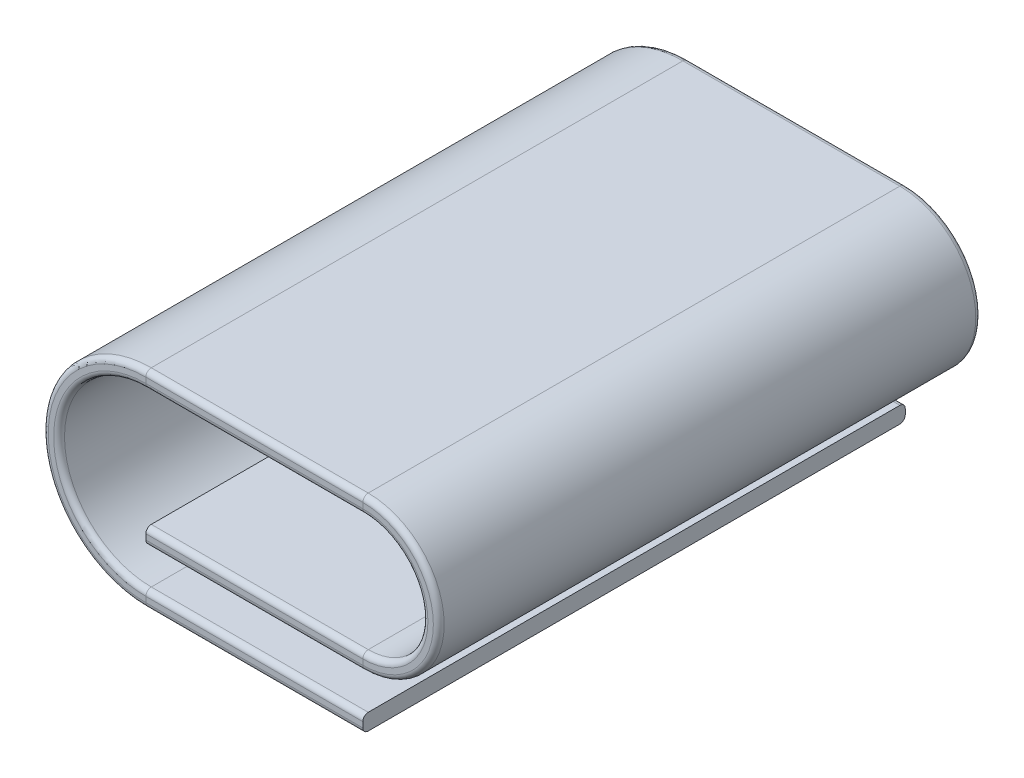
ISO-10303-21;
HEADER;
FILE_DESCRIPTION(('STEP AP214'),'2;1');
FILE_NAME('part.step','',(''),(''),'','','');
FILE_SCHEMA(('AUTOMOTIVE_DESIGN { 1 0 10303 214 1 1 1 1 }'));
ENDSEC;
DATA;
#1=APPLICATION_CONTEXT('core data for automotive mechanical design processes');
#2=APPLICATION_PROTOCOL_DEFINITION('international standard','automotive_design',2000,#1);
#3=PRODUCT_CONTEXT('',#1,'mechanical');
#4=PRODUCT('Part','Part','',(#3));
#5=PRODUCT_RELATED_PRODUCT_CATEGORY('part','',(#4));
#6=PRODUCT_DEFINITION_FORMATION('','',#4);
#7=PRODUCT_DEFINITION_CONTEXT('part definition',#1,'design');
#8=PRODUCT_DEFINITION('design','',#6,#7);
#9=PRODUCT_DEFINITION_SHAPE('','',#8);
#10=(LENGTH_UNIT() NAMED_UNIT(*) SI_UNIT(.MILLI.,.METRE.));
#11=(NAMED_UNIT(*) PLANE_ANGLE_UNIT() SI_UNIT($,.RADIAN.));
#12=(NAMED_UNIT(*) SI_UNIT($,.STERADIAN.) SOLID_ANGLE_UNIT());
#13=UNCERTAINTY_MEASURE_WITH_UNIT(LENGTH_MEASURE(1.E-05),#10,'distance_accuracy_value','');
#14=(GEOMETRIC_REPRESENTATION_CONTEXT(3) GLOBAL_UNCERTAINTY_ASSIGNED_CONTEXT((#13)) GLOBAL_UNIT_ASSIGNED_CONTEXT((#10,
#11,#12)) REPRESENTATION_CONTEXT('',''));
#15=CARTESIAN_POINT('',(0.,0.,0.));
#16=DIRECTION('',(0.,0.,1.));
#17=DIRECTION('',(1.,0.,0.));
#18=AXIS2_PLACEMENT_3D('',#15,#16,#17);
#19=CARTESIAN_POINT('',(1.,1.6,2.5));
#20=DIRECTION('',(0.,0.,1.));
#21=DIRECTION('',(1.,0.,0.));
#22=AXIS2_PLACEMENT_3D('',#19,#20,#21);
#23=PLANE('',#22);
#24=DIRECTION('',(0.,1.,0.));
#25=VECTOR('',#24,1.);
#26=CARTESIAN_POINT('',(1.,0.35,2.5));
#27=LINE('',#26,#25);
#28=CARTESIAN_POINT('',(1.,0.4,2.5));
#29=VERTEX_POINT('',#28);
#30=CARTESIAN_POINT('',(1.,0.45,2.5));
#31=VERTEX_POINT('',#30);
#32=EDGE_CURVE('E230',#29,#31,#27,.T.);
#33=ORIENTED_EDGE('',*,*,#32,.F.);
#34=CARTESIAN_POINT('',(1.,1.05,2.5));
#35=DIRECTION('',(0.,0.,1.));
#36=DIRECTION('',(1.,0.,0.));
#37=AXIS2_PLACEMENT_3D('',#34,#35,#36);
#38=CIRCLE('',#37,0.65);
#39=CARTESIAN_POINT('',(1.,1.7,2.5));
#40=VERTEX_POINT('',#39);
#41=EDGE_CURVE('E216',#29,#40,#38,.T.);
#42=ORIENTED_EDGE('',*,*,#41,.T.);
#43=DIRECTION('',(0.,1.,0.));
#44=VECTOR('',#43,1.);
#45=CARTESIAN_POINT('',(1.,1.6,2.5));
#46=LINE('',#45,#44);
#47=CARTESIAN_POINT('',(1.,1.65,2.5));
#48=VERTEX_POINT('',#47);
#49=EDGE_CURVE('E238',#48,#40,#46,.T.);
#50=ORIENTED_EDGE('',*,*,#49,.F.);
#51=CARTESIAN_POINT('',(1.,1.05,2.5));
#52=DIRECTION('',(0.,0.,1.));
#53=DIRECTION('',(1.,0.,0.));
#54=AXIS2_PLACEMENT_3D('',#51,#52,#53);
#55=CIRCLE('',#54,0.6);
#56=EDGE_CURVE('E224',#48,#31,#55,.F.);
#57=ORIENTED_EDGE('',*,*,#56,.T.);
#58=EDGE_LOOP('',(#33,#42,#50,#57));
#59=FACE_BOUND('',#58,.T.);
#60=ADVANCED_FACE('F39',(#59),#23,.T.);
#61=CARTESIAN_POINT('',(1.,0.35,2.5));
#62=DIRECTION('',(0.,0.,1.));
#63=DIRECTION('',(1.,0.,0.));
#64=AXIS2_PLACEMENT_3D('',#61,#62,#63);
#65=PLANE('',#64);
#66=ORIENTED_EDGE('',*,*,#49,.T.);
#67=DIRECTION('',(-1.,0.,0.));
#68=VECTOR('',#67,1.);
#69=CARTESIAN_POINT('',(-1.,1.7,2.5));
#70=LINE('',#69,#68);
#71=CARTESIAN_POINT('',(-1.,1.7,2.5));
#72=VERTEX_POINT('',#71);
#73=EDGE_CURVE('E322',#40,#72,#70,.T.);
#74=ORIENTED_EDGE('',*,*,#73,.T.);
#75=DIRECTION('',(0.,-1.,0.));
#76=VECTOR('',#75,1.);
#77=CARTESIAN_POINT('',(-1.,1.75,2.5));
#78=LINE('',#77,#76);
#79=CARTESIAN_POINT('',(-1.,1.65,2.5));
#80=VERTEX_POINT('',#79);
#81=EDGE_CURVE('E440',#72,#80,#78,.T.);
#82=ORIENTED_EDGE('',*,*,#81,.T.);
#83=DIRECTION('',(-1.,0.,0.));
#84=VECTOR('',#83,1.);
#85=CARTESIAN_POINT('',(1.,1.65,2.5));
#86=LINE('',#85,#84);
#87=EDGE_CURVE('E320',#80,#48,#86,.F.);
#88=ORIENTED_EDGE('',*,*,#87,.T.);
#89=EDGE_LOOP('',(#66,#74,#82,#88));
#90=FACE_BOUND('',#89,.T.);
#91=ADVANCED_FACE('F502',(#90),#65,.T.);
#92=CARTESIAN_POINT('',(1.,0.5,-2.5));
#93=DIRECTION('',(0.,0.,-1.));
#94=DIRECTION('',(-1.,0.,0.));
#95=AXIS2_PLACEMENT_3D('',#92,#93,#94);
#96=PLANE('',#95);
#97=DIRECTION('',(0.,-1.,0.));
#98=VECTOR('',#97,1.);
#99=CARTESIAN_POINT('',(1.,1.75,-2.5));
#100=LINE('',#99,#98);
#101=CARTESIAN_POINT('',(1.,1.7,-2.5));
#102=VERTEX_POINT('',#101);
#103=CARTESIAN_POINT('',(1.,1.65,-2.5));
#104=VERTEX_POINT('',#103);
#105=EDGE_CURVE('E243',#102,#104,#100,.T.);
#106=ORIENTED_EDGE('',*,*,#105,.F.);
#107=CARTESIAN_POINT('',(1.,1.05,-2.5));
#108=DIRECTION('',(0.,0.,-1.));
#109=DIRECTION('',(-1.,0.,0.));
#110=AXIS2_PLACEMENT_3D('',#107,#108,#109);
#111=CIRCLE('',#110,0.65);
#112=CARTESIAN_POINT('',(1.,0.4,-2.5));
#113=VERTEX_POINT('',#112);
#114=EDGE_CURVE('E311',#102,#113,#111,.T.);
#115=ORIENTED_EDGE('',*,*,#114,.T.);
#116=DIRECTION('',(0.,-1.,0.));
#117=VECTOR('',#116,1.);
#118=CARTESIAN_POINT('',(1.,0.5,-2.5));
#119=LINE('',#118,#117);
#120=CARTESIAN_POINT('',(1.,0.45,-2.5));
#121=VERTEX_POINT('',#120);
#122=EDGE_CURVE('E239',#121,#113,#119,.T.);
#123=ORIENTED_EDGE('',*,*,#122,.F.);
#124=CARTESIAN_POINT('',(1.,1.05,-2.5));
#125=DIRECTION('',(0.,0.,-1.));
#126=DIRECTION('',(-1.,0.,0.));
#127=AXIS2_PLACEMENT_3D('',#124,#125,#126);
#128=CIRCLE('',#127,0.6);
#129=EDGE_CURVE('E309',#121,#104,#128,.F.);
#130=ORIENTED_EDGE('',*,*,#129,.T.);
#131=EDGE_LOOP('',(#106,#115,#123,#130));
#132=FACE_BOUND('',#131,.T.);
#133=ADVANCED_FACE('F565',(#132),#96,.T.);
#134=CARTESIAN_POINT('',(1.,1.75,-2.5));
#135=DIRECTION('',(0.,0.,-1.));
#136=DIRECTION('',(-1.,0.,0.));
#137=AXIS2_PLACEMENT_3D('',#134,#135,#136);
#138=PLANE('',#137);
#139=ORIENTED_EDGE('',*,*,#122,.T.);
#140=DIRECTION('',(1.,0.,0.));
#141=VECTOR('',#140,1.);
#142=CARTESIAN_POINT('',(-1.,0.4,-2.5));
#143=LINE('',#142,#141);
#144=CARTESIAN_POINT('',(-1.,0.4,-2.5));
#145=VERTEX_POINT('',#144);
#146=EDGE_CURVE('E307',#113,#145,#143,.F.);
#147=ORIENTED_EDGE('',*,*,#146,.T.);
#148=DIRECTION('',(0.,1.,0.));
#149=VECTOR('',#148,1.);
#150=CARTESIAN_POINT('',(-1.,0.35,-2.5));
#151=LINE('',#150,#149);
#152=CARTESIAN_POINT('',(-1.,0.45,-2.5));
#153=VERTEX_POINT('',#152);
#154=EDGE_CURVE('E395',#145,#153,#151,.T.);
#155=ORIENTED_EDGE('',*,*,#154,.T.);
#156=DIRECTION('',(1.,0.,0.));
#157=VECTOR('',#156,1.);
#158=CARTESIAN_POINT('',(1.,0.45,-2.5));
#159=LINE('',#158,#157);
#160=EDGE_CURVE('E304',#153,#121,#159,.T.);
#161=ORIENTED_EDGE('',*,*,#160,.T.);
#162=EDGE_LOOP('',(#139,#147,#155,#161));
#163=FACE_BOUND('',#162,.T.);
#164=ADVANCED_FACE('F476',(#163),#138,.T.);
#165=CARTESIAN_POINT('',(-1.,0.,2.5));
#166=DIRECTION('',(0.,0.,1.));
#167=DIRECTION('',(1.,0.,0.));
#168=AXIS2_PLACEMENT_3D('',#165,#166,#167);
#169=PLANE('',#168);
#170=ORIENTED_EDGE('',*,*,#81,.F.);
#171=CARTESIAN_POINT('',(-1.,0.8,2.5));
#172=DIRECTION('',(0.,0.,1.));
#173=DIRECTION('',(1.,0.,0.));
#174=AXIS2_PLACEMENT_3D('',#171,#172,#173);
#175=CIRCLE('',#174,0.9);
#176=CARTESIAN_POINT('',(-1.,-0.0999999999999998,2.5));
#177=VERTEX_POINT('',#176);
#178=EDGE_CURVE('E281',#72,#177,#175,.T.);
#179=ORIENTED_EDGE('',*,*,#178,.T.);
#180=DIRECTION('',(0.,-1.,0.));
#181=VECTOR('',#180,1.);
#182=CARTESIAN_POINT('',(-1.,0.,2.5));
#183=LINE('',#182,#181);
#184=CARTESIAN_POINT('',(-1.,-0.0499999999999999,2.5));
#185=VERTEX_POINT('',#184);
#186=EDGE_CURVE('E443',#185,#177,#183,.T.);
#187=ORIENTED_EDGE('',*,*,#186,.F.);
#188=CARTESIAN_POINT('',(-1.,0.8,2.5));
#189=DIRECTION('',(0.,0.,1.));
#190=DIRECTION('',(1.,0.,0.));
#191=AXIS2_PLACEMENT_3D('',#188,#189,#190);
#192=CIRCLE('',#191,0.85);
#193=EDGE_CURVE('E279',#185,#80,#192,.F.);
#194=ORIENTED_EDGE('',*,*,#193,.T.);
#195=EDGE_LOOP('',(#170,#179,#187,#194));
#196=FACE_BOUND('',#195,.T.);
#197=ADVANCED_FACE('F506',(#196),#169,.T.);
#198=CARTESIAN_POINT('',(-1.,1.75,2.5));
#199=DIRECTION('',(0.,0.,1.));
#200=DIRECTION('',(1.,0.,0.));
#201=AXIS2_PLACEMENT_3D('',#198,#199,#200);
#202=PLANE('',#201);
#203=ORIENTED_EDGE('',*,*,#186,.T.);
#204=DIRECTION('',(1.,0.,0.));
#205=VECTOR('',#204,1.);
#206=CARTESIAN_POINT('',(1.,-0.1,2.5));
#207=LINE('',#206,#205);
#208=CARTESIAN_POINT('',(1.,-0.1,2.5));
#209=VERTEX_POINT('',#208);
#210=EDGE_CURVE('E265',#177,#209,#207,.T.);
#211=ORIENTED_EDGE('',*,*,#210,.T.);
#212=DIRECTION('',(0.,-1.,0.));
#213=VECTOR('',#212,1.);
#214=CARTESIAN_POINT('',(1.,0.,2.5));
#215=LINE('',#214,#213);
#216=CARTESIAN_POINT('',(1.,-0.05,2.5));
#217=VERTEX_POINT('',#216);
#218=EDGE_CURVE('E398',#217,#209,#215,.T.);
#219=ORIENTED_EDGE('',*,*,#218,.F.);
#220=DIRECTION('',(1.,0.,0.));
#221=VECTOR('',#220,1.);
#222=CARTESIAN_POINT('',(-1.,-0.0499999999999999,2.5));
#223=LINE('',#222,#221);
#224=EDGE_CURVE('E263',#217,#185,#223,.F.);
#225=ORIENTED_EDGE('',*,*,#224,.T.);
#226=EDGE_LOOP('',(#203,#211,#219,#225));
#227=FACE_BOUND('',#226,.T.);
#228=ADVANCED_FACE('F520',(#227),#202,.T.);
#229=CARTESIAN_POINT('',(-1.,1.6,-2.5));
#230=DIRECTION('',(0.,0.,-1.));
#231=DIRECTION('',(-1.,0.,0.));
#232=AXIS2_PLACEMENT_3D('',#229,#230,#231);
#233=PLANE('',#232);
#234=DIRECTION('',(0.,1.,0.));
#235=VECTOR('',#234,1.);
#236=CARTESIAN_POINT('',(-1.,-0.15,-2.5));
#237=LINE('',#236,#235);
#238=CARTESIAN_POINT('',(-1.,-0.0999999999999998,-2.5));
#239=VERTEX_POINT('',#238);
#240=CARTESIAN_POINT('',(-1.,-0.0499999999999999,-2.5));
#241=VERTEX_POINT('',#240);
#242=EDGE_CURVE('E387',#239,#241,#237,.T.);
#243=ORIENTED_EDGE('',*,*,#242,.F.);
#244=CARTESIAN_POINT('',(-1.,0.8,-2.5));
#245=DIRECTION('',(0.,0.,-1.));
#246=DIRECTION('',(-1.,0.,0.));
#247=AXIS2_PLACEMENT_3D('',#244,#245,#246);
#248=CIRCLE('',#247,0.9);
#249=CARTESIAN_POINT('',(-1.,1.7,-2.5));
#250=VERTEX_POINT('',#249);
#251=EDGE_CURVE('E56',#239,#250,#248,.T.);
#252=ORIENTED_EDGE('',*,*,#251,.T.);
#253=DIRECTION('',(0.,1.,0.));
#254=VECTOR('',#253,1.);
#255=CARTESIAN_POINT('',(-1.,1.6,-2.5));
#256=LINE('',#255,#254);
#257=CARTESIAN_POINT('',(-1.,1.65,-2.5));
#258=VERTEX_POINT('',#257);
#259=EDGE_CURVE('E438',#258,#250,#256,.T.);
#260=ORIENTED_EDGE('',*,*,#259,.F.);
#261=CARTESIAN_POINT('',(-1.,0.8,-2.5));
#262=DIRECTION('',(0.,0.,-1.));
#263=DIRECTION('',(-1.,0.,0.));
#264=AXIS2_PLACEMENT_3D('',#261,#262,#263);
#265=CIRCLE('',#264,0.85);
#266=EDGE_CURVE('E317',#258,#241,#265,.F.);
#267=ORIENTED_EDGE('',*,*,#266,.T.);
#268=EDGE_LOOP('',(#243,#252,#260,#267));
#269=FACE_BOUND('',#268,.T.);
#270=ADVANCED_FACE('F859',(#269),#233,.T.);
#271=CARTESIAN_POINT('',(-1.,-0.15,-2.5));
#272=DIRECTION('',(0.,0.,-1.));
#273=DIRECTION('',(-1.,0.,0.));
#274=AXIS2_PLACEMENT_3D('',#271,#272,#273);
#275=PLANE('',#274);
#276=ORIENTED_EDGE('',*,*,#259,.T.);
#277=DIRECTION('',(-1.,0.,0.));
#278=VECTOR('',#277,1.);
#279=CARTESIAN_POINT('',(1.,1.7,-2.5));
#280=LINE('',#279,#278);
#281=EDGE_CURVE('E11',#250,#102,#280,.F.);
#282=ORIENTED_EDGE('',*,*,#281,.T.);
#283=ORIENTED_EDGE('',*,*,#105,.T.);
#284=DIRECTION('',(-1.,0.,0.));
#285=VECTOR('',#284,1.);
#286=CARTESIAN_POINT('',(-1.,1.65,-2.5));
#287=LINE('',#286,#285);
#288=EDGE_CURVE('E48',#104,#258,#287,.T.);
#289=ORIENTED_EDGE('',*,*,#288,.T.);
#290=EDGE_LOOP('',(#276,#282,#283,#289));
#291=FACE_BOUND('',#290,.T.);
#292=ADVANCED_FACE('F446',(#291),#275,.T.);
#293=CARTESIAN_POINT('',(-1.,-0.15,2.5));
#294=DIRECTION('',(0.,1.,0.));
#295=DIRECTION('',(0.,0.,1.));
#296=AXIS2_PLACEMENT_3D('',#293,#294,#295);
#297=PLANE('',#296);
#298=DIRECTION('',(0.,0.,-1.));
#299=VECTOR('',#298,1.);
#300=CARTESIAN_POINT('',(1.,-0.15,2.5));
#301=LINE('',#300,#299);
#302=CARTESIAN_POINT('',(1.,-0.15,2.45));
#303=VERTEX_POINT('',#302);
#304=CARTESIAN_POINT('',(1.,-0.15,-2.45));
#305=VERTEX_POINT('',#304);
#306=EDGE_CURVE('E435',#303,#305,#301,.T.);
#307=ORIENTED_EDGE('',*,*,#306,.F.);
#308=DIRECTION('',(1.,0.,0.));
#309=VECTOR('',#308,1.);
#310=CARTESIAN_POINT('',(-1.,-0.15,2.45));
#311=LINE('',#310,#309);
#312=CARTESIAN_POINT('',(-1.,-0.15,2.45));
#313=VERTEX_POINT('',#312);
#314=EDGE_CURVE('E277',#303,#313,#311,.F.);
#315=ORIENTED_EDGE('',*,*,#314,.T.);
#316=DIRECTION('',(0.,0.,-1.));
#317=VECTOR('',#316,1.);
#318=CARTESIAN_POINT('',(-1.,-0.15,2.5));
#319=LINE('',#318,#317);
#320=CARTESIAN_POINT('',(-1.,-0.15,-2.45));
#321=VERTEX_POINT('',#320);
#322=EDGE_CURVE('E403',#313,#321,#319,.T.);
#323=ORIENTED_EDGE('',*,*,#322,.T.);
#324=DIRECTION('',(1.,0.,0.));
#325=VECTOR('',#324,1.);
#326=CARTESIAN_POINT('',(-1.,-0.15,-2.45));
#327=LINE('',#326,#325);
#328=EDGE_CURVE('E275',#321,#305,#327,.T.);
#329=ORIENTED_EDGE('',*,*,#328,.T.);
#330=EDGE_LOOP('',(#307,#315,#323,#329));
#331=FACE_BOUND('',#330,.T.);
#332=ADVANCED_FACE('F839',(#331),#297,.F.);
#333=CARTESIAN_POINT('',(1.,0.,2.5));
#334=DIRECTION('',(1.,0.,0.));
#335=DIRECTION('',(0.,0.,-1.));
#336=AXIS2_PLACEMENT_3D('',#333,#334,#335);
#337=PLANE('',#336);
#338=ORIENTED_EDGE('',*,*,#218,.T.);
#339=CARTESIAN_POINT('',(1.,-0.1,2.45));
#340=DIRECTION('',(1.,0.,0.));
#341=DIRECTION('',(0.,0.,-1.));
#342=AXIS2_PLACEMENT_3D('',#339,#340,#341);
#343=CIRCLE('',#342,0.05);
#344=EDGE_CURVE('E273',#209,#303,#343,.T.);
#345=ORIENTED_EDGE('',*,*,#344,.T.);
#346=ORIENTED_EDGE('',*,*,#306,.T.);
#347=CARTESIAN_POINT('',(1.,-0.1,-2.45));
#348=DIRECTION('',(1.,0.,0.));
#349=DIRECTION('',(0.,0.,-1.));
#350=AXIS2_PLACEMENT_3D('',#347,#348,#349);
#351=CIRCLE('',#350,0.05);
#352=CARTESIAN_POINT('',(1.,-0.1,-2.5));
#353=VERTEX_POINT('',#352);
#354=EDGE_CURVE('E269',#305,#353,#351,.T.);
#355=ORIENTED_EDGE('',*,*,#354,.T.);
#356=DIRECTION('',(0.,-1.,0.));
#357=VECTOR('',#356,1.);
#358=CARTESIAN_POINT('',(1.,0.,-2.5));
#359=LINE('',#358,#357);
#360=CARTESIAN_POINT('',(1.,-0.05,-2.5));
#361=VERTEX_POINT('',#360);
#362=EDGE_CURVE('E340',#361,#353,#359,.T.);
#363=ORIENTED_EDGE('',*,*,#362,.F.);
#364=CARTESIAN_POINT('',(1.,-0.05,-2.45));
#365=DIRECTION('',(1.,0.,0.));
#366=DIRECTION('',(0.,0.,-1.));
#367=AXIS2_PLACEMENT_3D('',#364,#365,#366);
#368=CIRCLE('',#367,0.05);
#369=CARTESIAN_POINT('',(1.,0.,-2.45));
#370=VERTEX_POINT('',#369);
#371=EDGE_CURVE('E267',#361,#370,#368,.T.);
#372=ORIENTED_EDGE('',*,*,#371,.T.);
#373=DIRECTION('',(0.,0.,-1.));
#374=VECTOR('',#373,1.);
#375=CARTESIAN_POINT('',(1.,0.,2.5));
#376=LINE('',#375,#374);
#377=CARTESIAN_POINT('',(1.,0.,2.45));
#378=VERTEX_POINT('',#377);
#379=EDGE_CURVE('E433',#378,#370,#376,.T.);
#380=ORIENTED_EDGE('',*,*,#379,.F.);
#381=CARTESIAN_POINT('',(1.,-0.05,2.45));
#382=DIRECTION('',(1.,0.,0.));
#383=DIRECTION('',(0.,0.,-1.));
#384=AXIS2_PLACEMENT_3D('',#381,#382,#383);
#385=CIRCLE('',#384,0.05);
#386=EDGE_CURVE('E271',#378,#217,#385,.T.);
#387=ORIENTED_EDGE('',*,*,#386,.T.);
#388=EDGE_LOOP('',(#338,#345,#346,#355,#363,#372,#380,#387));
#389=FACE_BOUND('',#388,.T.);
#390=ADVANCED_FACE('F390',(#389),#337,.T.);
#391=CARTESIAN_POINT('',(-1.,0.,2.5));
#392=DIRECTION('',(0.,1.,0.));
#393=DIRECTION('',(0.,0.,1.));
#394=AXIS2_PLACEMENT_3D('',#391,#392,#393);
#395=PLANE('',#394);
#396=DIRECTION('',(0.,0.,-1.));
#397=VECTOR('',#396,1.);
#398=CARTESIAN_POINT('',(-1.,0.,2.5));
#399=LINE('',#398,#397);
#400=CARTESIAN_POINT('',(-1.,0.,2.45));
#401=VERTEX_POINT('',#400);
#402=CARTESIAN_POINT('',(-1.,0.,-2.45));
#403=VERTEX_POINT('',#402);
#404=EDGE_CURVE('E430',#401,#403,#399,.T.);
#405=ORIENTED_EDGE('',*,*,#404,.F.);
#406=DIRECTION('',(1.,0.,0.));
#407=VECTOR('',#406,1.);
#408=CARTESIAN_POINT('',(-1.,0.,2.45));
#409=LINE('',#408,#407);
#410=EDGE_CURVE('E298',#401,#378,#409,.T.);
#411=ORIENTED_EDGE('',*,*,#410,.T.);
#412=ORIENTED_EDGE('',*,*,#379,.T.);
#413=DIRECTION('',(1.,0.,0.));
#414=VECTOR('',#413,1.);
#415=CARTESIAN_POINT('',(-1.,0.,-2.45));
#416=LINE('',#415,#414);
#417=EDGE_CURVE('E296',#370,#403,#416,.F.);
#418=ORIENTED_EDGE('',*,*,#417,.T.);
#419=EDGE_LOOP('',(#405,#411,#412,#418));
#420=FACE_BOUND('',#419,.T.);
#421=ADVANCED_FACE('F548',(#420),#395,.T.);
#422=CARTESIAN_POINT('',(-1.,0.8,2.5));
#423=DIRECTION('',(0.,0.,-1.));
#424=DIRECTION('',(-1.,0.,0.));
#425=AXIS2_PLACEMENT_3D('',#422,#423,#424);
#426=CYLINDRICAL_SURFACE('',#425,0.8);
#427=DIRECTION('',(0.,0.,-1.));
#428=VECTOR('',#427,1.);
#429=CARTESIAN_POINT('',(-1.,1.6,2.5));
#430=LINE('',#429,#428);
#431=CARTESIAN_POINT('',(-1.,1.6,2.45));
#432=VERTEX_POINT('',#431);
#433=CARTESIAN_POINT('',(-1.,1.6,-2.45));
#434=VERTEX_POINT('',#433);
#435=EDGE_CURVE('E427',#432,#434,#430,.T.);
#436=ORIENTED_EDGE('',*,*,#435,.F.);
#437=CARTESIAN_POINT('',(-1.,0.8,2.45));
#438=DIRECTION('',(0.,0.,1.));
#439=DIRECTION('',(1.,0.,0.));
#440=AXIS2_PLACEMENT_3D('',#437,#438,#439);
#441=CIRCLE('',#440,0.8);
#442=EDGE_CURVE('E302',#432,#401,#441,.T.);
#443=ORIENTED_EDGE('',*,*,#442,.T.);
#444=ORIENTED_EDGE('',*,*,#404,.T.);
#445=CARTESIAN_POINT('',(-1.,0.8,-2.45));
#446=DIRECTION('',(0.,0.,-1.));
#447=DIRECTION('',(-1.,0.,0.));
#448=AXIS2_PLACEMENT_3D('',#445,#446,#447);
#449=CIRCLE('',#448,0.8);
#450=EDGE_CURVE('E300',#403,#434,#449,.T.);
#451=ORIENTED_EDGE('',*,*,#450,.T.);
#452=EDGE_LOOP('',(#436,#443,#444,#451));
#453=FACE_BOUND('',#452,.T.);
#454=ADVANCED_FACE('F545',(#453),#426,.F.);
#455=CARTESIAN_POINT('',(1.,1.6,2.5));
#456=DIRECTION('',(0.,-1.,0.));
#457=DIRECTION('',(1.,0.,0.));
#458=AXIS2_PLACEMENT_3D('',#455,#456,#457);
#459=PLANE('',#458);
#460=DIRECTION('',(0.,0.,-1.));
#461=VECTOR('',#460,1.);
#462=CARTESIAN_POINT('',(1.,1.6,2.5));
#463=LINE('',#462,#461);
#464=CARTESIAN_POINT('',(1.,1.6,2.45));
#465=VERTEX_POINT('',#464);
#466=CARTESIAN_POINT('',(1.,1.6,-2.45));
#467=VERTEX_POINT('',#466);
#468=EDGE_CURVE('E424',#465,#467,#463,.T.);
#469=ORIENTED_EDGE('',*,*,#468,.F.);
#470=DIRECTION('',(-1.,0.,0.));
#471=VECTOR('',#470,1.);
#472=CARTESIAN_POINT('',(1.,1.6,2.45));
#473=LINE('',#472,#471);
#474=EDGE_CURVE('E330',#465,#432,#473,.T.);
#475=ORIENTED_EDGE('',*,*,#474,.T.);
#476=ORIENTED_EDGE('',*,*,#435,.T.);
#477=DIRECTION('',(-1.,0.,0.));
#478=VECTOR('',#477,1.);
#479=CARTESIAN_POINT('',(1.,1.6,-2.45));
#480=LINE('',#479,#478);
#481=EDGE_CURVE('E328',#434,#467,#480,.F.);
#482=ORIENTED_EDGE('',*,*,#481,.T.);
#483=EDGE_LOOP('',(#469,#475,#476,#482));
#484=FACE_BOUND('',#483,.T.);
#485=ADVANCED_FACE('F534',(#484),#459,.T.);
#486=CARTESIAN_POINT('',(1.,1.05,2.5));
#487=DIRECTION('',(0.,0.,-1.));
#488=DIRECTION('',(-1.,0.,0.));
#489=AXIS2_PLACEMENT_3D('',#486,#487,#488);
#490=CYLINDRICAL_SURFACE('',#489,0.55);
#491=DIRECTION('',(0.,0.,-1.));
#492=VECTOR('',#491,1.);
#493=CARTESIAN_POINT('',(1.,0.5,2.5));
#494=LINE('',#493,#492);
#495=CARTESIAN_POINT('',(1.,0.5,2.45));
#496=VERTEX_POINT('',#495);
#497=CARTESIAN_POINT('',(1.,0.5,-2.45));
#498=VERTEX_POINT('',#497);
#499=EDGE_CURVE('E421',#496,#498,#494,.T.);
#500=ORIENTED_EDGE('',*,*,#499,.F.);
#501=CARTESIAN_POINT('',(1.,1.05,2.45));
#502=DIRECTION('',(0.,0.,1.));
#503=DIRECTION('',(1.,0.,0.));
#504=AXIS2_PLACEMENT_3D('',#501,#502,#503);
#505=CIRCLE('',#504,0.55);
#506=EDGE_CURVE('E294',#496,#465,#505,.T.);
#507=ORIENTED_EDGE('',*,*,#506,.T.);
#508=ORIENTED_EDGE('',*,*,#468,.T.);
#509=CARTESIAN_POINT('',(1.,1.05,-2.45));
#510=DIRECTION('',(0.,0.,-1.));
#511=DIRECTION('',(-1.,0.,0.));
#512=AXIS2_PLACEMENT_3D('',#509,#510,#511);
#513=CIRCLE('',#512,0.55);
#514=EDGE_CURVE('E292',#467,#498,#513,.T.);
#515=ORIENTED_EDGE('',*,*,#514,.T.);
#516=EDGE_LOOP('',(#500,#507,#508,#515));
#517=FACE_BOUND('',#516,.T.);
#518=ADVANCED_FACE('F459',(#517),#490,.F.);
#519=CARTESIAN_POINT('',(-1.,0.5,2.5));
#520=DIRECTION('',(0.,1.,0.));
#521=DIRECTION('',(0.,0.,1.));
#522=AXIS2_PLACEMENT_3D('',#519,#520,#521);
#523=PLANE('',#522);
#524=DIRECTION('',(0.,0.,-1.));
#525=VECTOR('',#524,1.);
#526=CARTESIAN_POINT('',(-1.,0.5,2.5));
#527=LINE('',#526,#525);
#528=CARTESIAN_POINT('',(-1.,0.5,2.45));
#529=VERTEX_POINT('',#528);
#530=CARTESIAN_POINT('',(-1.,0.5,-2.45));
#531=VERTEX_POINT('',#530);
#532=EDGE_CURVE('E418',#529,#531,#527,.T.);
#533=ORIENTED_EDGE('',*,*,#532,.F.);
#534=DIRECTION('',(1.,0.,0.));
#535=VECTOR('',#534,1.);
#536=CARTESIAN_POINT('',(-1.,0.5,2.45));
#537=LINE('',#536,#535);
#538=EDGE_CURVE('E289',#529,#496,#537,.T.);
#539=ORIENTED_EDGE('',*,*,#538,.T.);
#540=ORIENTED_EDGE('',*,*,#499,.T.);
#541=DIRECTION('',(1.,0.,0.));
#542=VECTOR('',#541,1.);
#543=CARTESIAN_POINT('',(-1.,0.5,-2.45));
#544=LINE('',#543,#542);
#545=EDGE_CURVE('E287',#498,#531,#544,.F.);
#546=ORIENTED_EDGE('',*,*,#545,.T.);
#547=EDGE_LOOP('',(#533,#539,#540,#546));
#548=FACE_BOUND('',#547,.T.);
#549=ADVANCED_FACE('F464',(#548),#523,.T.);
#550=CARTESIAN_POINT('',(-1.,0.35,2.5));
#551=DIRECTION('',(-1.,0.,0.));
#552=DIRECTION('',(0.,0.,1.));
#553=AXIS2_PLACEMENT_3D('',#550,#551,#552);
#554=PLANE('',#553);
#555=DIRECTION('',(0.,0.,-1.));
#556=VECTOR('',#555,1.);
#557=CARTESIAN_POINT('',(-1.,0.35,2.5));
#558=LINE('',#557,#556);
#559=CARTESIAN_POINT('',(-1.,0.35,2.45));
#560=VERTEX_POINT('',#559);
#561=CARTESIAN_POINT('',(-1.,0.35,-2.45));
#562=VERTEX_POINT('',#561);
#563=EDGE_CURVE('E415',#560,#562,#558,.T.);
#564=ORIENTED_EDGE('',*,*,#563,.F.);
#565=CARTESIAN_POINT('',(-1.,0.4,2.45));
#566=DIRECTION('',(-1.,0.,0.));
#567=DIRECTION('',(0.,0.,1.));
#568=AXIS2_PLACEMENT_3D('',#565,#566,#567);
#569=CIRCLE('',#568,0.05);
#570=CARTESIAN_POINT('',(-1.,0.4,2.5));
#571=VERTEX_POINT('',#570);
#572=EDGE_CURVE('E257',#560,#571,#569,.T.);
#573=ORIENTED_EDGE('',*,*,#572,.T.);
#574=DIRECTION('',(0.,1.,0.));
#575=VECTOR('',#574,1.);
#576=CARTESIAN_POINT('',(-1.,0.35,2.5));
#577=LINE('',#576,#575);
#578=CARTESIAN_POINT('',(-1.,0.45,2.5));
#579=VERTEX_POINT('',#578);
#580=EDGE_CURVE('E233',#571,#579,#577,.T.);
#581=ORIENTED_EDGE('',*,*,#580,.T.);
#582=CARTESIAN_POINT('',(-1.,0.45,2.45));
#583=DIRECTION('',(-1.,0.,0.));
#584=DIRECTION('',(0.,0.,1.));
#585=AXIS2_PLACEMENT_3D('',#582,#583,#584);
#586=CIRCLE('',#585,0.05);
#587=EDGE_CURVE('E255',#579,#529,#586,.T.);
#588=ORIENTED_EDGE('',*,*,#587,.T.);
#589=ORIENTED_EDGE('',*,*,#532,.T.);
#590=CARTESIAN_POINT('',(-1.,0.45,-2.45));
#591=DIRECTION('',(-1.,0.,0.));
#592=DIRECTION('',(0.,0.,1.));
#593=AXIS2_PLACEMENT_3D('',#590,#591,#592);
#594=CIRCLE('',#593,0.05);
#595=EDGE_CURVE('E251',#531,#153,#594,.T.);
#596=ORIENTED_EDGE('',*,*,#595,.T.);
#597=ORIENTED_EDGE('',*,*,#154,.F.);
#598=CARTESIAN_POINT('',(-1.,0.4,-2.45));
#599=DIRECTION('',(-1.,0.,0.));
#600=DIRECTION('',(0.,0.,1.));
#601=AXIS2_PLACEMENT_3D('',#598,#599,#600);
#602=CIRCLE('',#601,0.05);
#603=EDGE_CURVE('E253',#145,#562,#602,.T.);
#604=ORIENTED_EDGE('',*,*,#603,.T.);
#605=EDGE_LOOP('',(#564,#573,#581,#588,#589,#596,#597,#604));
#606=FACE_BOUND('',#605,.T.);
#607=ADVANCED_FACE('F473',(#606),#554,.T.);
#608=CARTESIAN_POINT('',(-1.,0.35,2.5));
#609=DIRECTION('',(0.,1.,0.));
#610=DIRECTION('',(0.,0.,1.));
#611=AXIS2_PLACEMENT_3D('',#608,#609,#610);
#612=PLANE('',#611);
#613=DIRECTION('',(0.,0.,-1.));
#614=VECTOR('',#613,1.);
#615=CARTESIAN_POINT('',(1.,0.35,2.5));
#616=LINE('',#615,#614);
#617=CARTESIAN_POINT('',(1.,0.35,2.45));
#618=VERTEX_POINT('',#617);
#619=CARTESIAN_POINT('',(1.,0.35,-2.45));
#620=VERTEX_POINT('',#619);
#621=EDGE_CURVE('E412',#618,#620,#616,.T.);
#622=ORIENTED_EDGE('',*,*,#621,.F.);
#623=DIRECTION('',(1.,0.,0.));
#624=VECTOR('',#623,1.);
#625=CARTESIAN_POINT('',(-1.,0.35,2.45));
#626=LINE('',#625,#624);
#627=EDGE_CURVE('E209',#618,#560,#626,.F.);
#628=ORIENTED_EDGE('',*,*,#627,.T.);
#629=ORIENTED_EDGE('',*,*,#563,.T.);
#630=DIRECTION('',(1.,0.,0.));
#631=VECTOR('',#630,1.);
#632=CARTESIAN_POINT('',(1.,0.35,-2.45));
#633=LINE('',#632,#631);
#634=EDGE_CURVE('E234',#562,#620,#633,.T.);
#635=ORIENTED_EDGE('',*,*,#634,.T.);
#636=EDGE_LOOP('',(#622,#628,#629,#635));
#637=FACE_BOUND('',#636,.T.);
#638=ADVANCED_FACE('F491',(#637),#612,.F.);
#639=CARTESIAN_POINT('',(1.,1.05,2.5));
#640=DIRECTION('',(0.,0.,-1.));
#641=DIRECTION('',(-1.,0.,0.));
#642=AXIS2_PLACEMENT_3D('',#639,#640,#641);
#643=CYLINDRICAL_SURFACE('',#642,0.7);
#644=DIRECTION('',(0.,0.,-1.));
#645=VECTOR('',#644,1.);
#646=CARTESIAN_POINT('',(1.,1.75,2.5));
#647=LINE('',#646,#645);
#648=CARTESIAN_POINT('',(1.,1.75,2.45));
#649=VERTEX_POINT('',#648);
#650=CARTESIAN_POINT('',(1.,1.75,-2.45));
#651=VERTEX_POINT('',#650);
#652=EDGE_CURVE('E409',#649,#651,#647,.T.);
#653=ORIENTED_EDGE('',*,*,#652,.F.);
#654=CARTESIAN_POINT('',(1.,1.05,2.45));
#655=DIRECTION('',(0.,0.,1.));
#656=DIRECTION('',(1.,0.,0.));
#657=AXIS2_PLACEMENT_3D('',#654,#655,#656);
#658=CIRCLE('',#657,0.7);
#659=EDGE_CURVE('E261',#649,#618,#658,.F.);
#660=ORIENTED_EDGE('',*,*,#659,.T.);
#661=ORIENTED_EDGE('',*,*,#621,.T.);
#662=CARTESIAN_POINT('',(1.,1.05,-2.45));
#663=DIRECTION('',(0.,0.,-1.));
#664=DIRECTION('',(-1.,0.,0.));
#665=AXIS2_PLACEMENT_3D('',#662,#663,#664);
#666=CIRCLE('',#665,0.7);
#667=EDGE_CURVE('E223',#620,#651,#666,.F.);
#668=ORIENTED_EDGE('',*,*,#667,.T.);
#669=EDGE_LOOP('',(#653,#660,#661,#668));
#670=FACE_BOUND('',#669,.T.);
#671=ADVANCED_FACE('F492',(#670),#643,.T.);
#672=CARTESIAN_POINT('',(1.,1.75,2.5));
#673=DIRECTION('',(0.,-1.,0.));
#674=DIRECTION('',(1.,0.,0.));
#675=AXIS2_PLACEMENT_3D('',#672,#673,#674);
#676=PLANE('',#675);
#677=DIRECTION('',(0.,0.,-1.));
#678=VECTOR('',#677,1.);
#679=CARTESIAN_POINT('',(-1.,1.75,2.5));
#680=LINE('',#679,#678);
#681=CARTESIAN_POINT('',(-1.,1.75,2.45));
#682=VERTEX_POINT('',#681);
#683=CARTESIAN_POINT('',(-1.,1.75,-2.45));
#684=VERTEX_POINT('',#683);
#685=EDGE_CURVE('E406',#682,#684,#680,.T.);
#686=ORIENTED_EDGE('',*,*,#685,.F.);
#687=DIRECTION('',(-1.,0.,0.));
#688=VECTOR('',#687,1.);
#689=CARTESIAN_POINT('',(1.,1.75,2.45));
#690=LINE('',#689,#688);
#691=EDGE_CURVE('E326',#682,#649,#690,.F.);
#692=ORIENTED_EDGE('',*,*,#691,.T.);
#693=ORIENTED_EDGE('',*,*,#652,.T.);
#694=DIRECTION('',(-1.,0.,0.));
#695=VECTOR('',#694,1.);
#696=CARTESIAN_POINT('',(-1.,1.75,-2.45));
#697=LINE('',#696,#695);
#698=EDGE_CURVE('E324',#651,#684,#697,.T.);
#699=ORIENTED_EDGE('',*,*,#698,.T.);
#700=EDGE_LOOP('',(#686,#692,#693,#699));
#701=FACE_BOUND('',#700,.T.);
#702=ADVANCED_FACE('F746',(#701),#676,.F.);
#703=CARTESIAN_POINT('',(-1.,0.8,2.5));
#704=DIRECTION('',(0.,0.,-1.));
#705=DIRECTION('',(-1.,0.,0.));
#706=AXIS2_PLACEMENT_3D('',#703,#704,#705);
#707=CYLINDRICAL_SURFACE('',#706,0.95);
#708=ORIENTED_EDGE('',*,*,#322,.F.);
#709=CARTESIAN_POINT('',(-1.,0.8,2.45));
#710=DIRECTION('',(0.,0.,1.));
#711=DIRECTION('',(1.,0.,0.));
#712=AXIS2_PLACEMENT_3D('',#709,#710,#711);
#713=CIRCLE('',#712,0.95);
#714=EDGE_CURVE('E285',#313,#682,#713,.F.);
#715=ORIENTED_EDGE('',*,*,#714,.T.);
#716=ORIENTED_EDGE('',*,*,#685,.T.);
#717=CARTESIAN_POINT('',(-1.,0.8,-2.45));
#718=DIRECTION('',(0.,0.,-1.));
#719=DIRECTION('',(-1.,0.,0.));
#720=AXIS2_PLACEMENT_3D('',#717,#718,#719);
#721=CIRCLE('',#720,0.95);
#722=EDGE_CURVE('E283',#684,#321,#721,.F.);
#723=ORIENTED_EDGE('',*,*,#722,.T.);
#724=EDGE_LOOP('',(#708,#715,#716,#723));
#725=FACE_BOUND('',#724,.T.);
#726=ADVANCED_FACE('F735',(#725),#707,.T.);
#727=CARTESIAN_POINT('',(-1.,0.8,2.5));
#728=DIRECTION('',(0.,0.,1.));
#729=DIRECTION('',(1.,0.,0.));
#730=AXIS2_PLACEMENT_3D('',#727,#728,#729);
#731=PLANE('',#730);
#732=ORIENTED_EDGE('',*,*,#580,.F.);
#733=DIRECTION('',(1.,0.,0.));
#734=VECTOR('',#733,1.);
#735=CARTESIAN_POINT('',(1.,0.4,2.5));
#736=LINE('',#735,#734);
#737=EDGE_CURVE('E208',#571,#29,#736,.T.);
#738=ORIENTED_EDGE('',*,*,#737,.T.);
#739=ORIENTED_EDGE('',*,*,#32,.T.);
#740=DIRECTION('',(1.,0.,0.));
#741=VECTOR('',#740,1.);
#742=CARTESIAN_POINT('',(-1.,0.45,2.5));
#743=LINE('',#742,#741);
#744=EDGE_CURVE('E235',#31,#579,#743,.F.);
#745=ORIENTED_EDGE('',*,*,#744,.T.);
#746=EDGE_LOOP('',(#732,#738,#739,#745));
#747=FACE_BOUND('',#746,.T.);
#748=ADVANCED_FACE('F229',(#747),#731,.T.);
#749=CARTESIAN_POINT('',(-1.,0.8,-2.5));
#750=DIRECTION('',(0.,0.,1.));
#751=DIRECTION('',(1.,0.,0.));
#752=AXIS2_PLACEMENT_3D('',#749,#750,#751);
#753=PLANE('',#752);
#754=ORIENTED_EDGE('',*,*,#362,.T.);
#755=DIRECTION('',(1.,0.,0.));
#756=VECTOR('',#755,1.);
#757=CARTESIAN_POINT('',(-1.,-0.1,-2.5));
#758=LINE('',#757,#756);
#759=EDGE_CURVE('E315',#353,#239,#758,.F.);
#760=ORIENTED_EDGE('',*,*,#759,.T.);
#761=ORIENTED_EDGE('',*,*,#242,.T.);
#762=DIRECTION('',(1.,0.,0.));
#763=VECTOR('',#762,1.);
#764=CARTESIAN_POINT('',(1.,-0.05,-2.5));
#765=LINE('',#764,#763);
#766=EDGE_CURVE('E313',#241,#361,#765,.T.);
#767=ORIENTED_EDGE('',*,*,#766,.T.);
#768=EDGE_LOOP('',(#754,#760,#761,#767));
#769=FACE_BOUND('',#768,.T.);
#770=ADVANCED_FACE('F385',(#769),#753,.F.);
#771=CARTESIAN_POINT('',(-1.,-0.1,2.45));
#772=DIRECTION('',(-1.,0.,0.));
#773=DIRECTION('',(0.,0.,1.));
#774=AXIS2_PLACEMENT_3D('',#771,#772,#773);
#775=CYLINDRICAL_SURFACE('',#774,0.05);
#776=ORIENTED_EDGE('',*,*,#344,.F.);
#777=ORIENTED_EDGE('',*,*,#210,.F.);
#778=CARTESIAN_POINT('',(-1.,-0.1,2.45));
#779=DIRECTION('',(-1.,0.,0.));
#780=DIRECTION('',(0.,0.,1.));
#781=AXIS2_PLACEMENT_3D('',#778,#779,#780);
#782=CIRCLE('',#781,0.05);
#783=EDGE_CURVE('E337',#313,#177,#782,.T.);
#784=ORIENTED_EDGE('',*,*,#783,.F.);
#785=ORIENTED_EDGE('',*,*,#314,.F.);
#786=EDGE_LOOP('',(#776,#777,#784,#785));
#787=FACE_BOUND('',#786,.T.);
#788=ADVANCED_FACE('F517',(#787),#775,.T.);
#789=CARTESIAN_POINT('',(-1.,0.8,2.45));
#790=DIRECTION('',(0.,0.,1.));
#791=DIRECTION('',(1.,0.,0.));
#792=AXIS2_PLACEMENT_3D('',#789,#790,#791);
#793=TOROIDAL_SURFACE('',#792,0.9,0.05);
#794=ORIENTED_EDGE('',*,*,#783,.T.);
#795=ORIENTED_EDGE('',*,*,#178,.F.);
#796=CARTESIAN_POINT('',(-1.,1.7,2.45));
#797=DIRECTION('',(1.,0.,0.));
#798=DIRECTION('',(0.,0.,-1.));
#799=AXIS2_PLACEMENT_3D('',#796,#797,#798);
#800=CIRCLE('',#799,0.05);
#801=EDGE_CURVE('E334',#682,#72,#800,.T.);
#802=ORIENTED_EDGE('',*,*,#801,.F.);
#803=ORIENTED_EDGE('',*,*,#714,.F.);
#804=EDGE_LOOP('',(#794,#795,#802,#803));
#805=FACE_BOUND('',#804,.T.);
#806=ADVANCED_FACE('F510',(#805),#793,.T.);
#807=CARTESIAN_POINT('',(1.,1.7,2.45));
#808=DIRECTION('',(1.,0.,0.));
#809=DIRECTION('',(0.,1.,0.));
#810=AXIS2_PLACEMENT_3D('',#807,#808,#809);
#811=CYLINDRICAL_SURFACE('',#810,0.05);
#812=ORIENTED_EDGE('',*,*,#801,.T.);
#813=ORIENTED_EDGE('',*,*,#73,.F.);
#814=CARTESIAN_POINT('',(1.,1.7,2.45));
#815=DIRECTION('',(1.,0.,0.));
#816=DIRECTION('',(0.,0.,-1.));
#817=AXIS2_PLACEMENT_3D('',#814,#815,#816);
#818=CIRCLE('',#817,0.05);
#819=EDGE_CURVE('E212',#649,#40,#818,.T.);
#820=ORIENTED_EDGE('',*,*,#819,.F.);
#821=ORIENTED_EDGE('',*,*,#691,.F.);
#822=EDGE_LOOP('',(#812,#813,#820,#821));
#823=FACE_BOUND('',#822,.T.);
#824=ADVANCED_FACE('F498',(#823),#811,.T.);
#825=CARTESIAN_POINT('',(1.,1.05,2.45));
#826=DIRECTION('',(0.,0.,1.));
#827=DIRECTION('',(1.,0.,0.));
#828=AXIS2_PLACEMENT_3D('',#825,#826,#827);
#829=TOROIDAL_SURFACE('',#828,0.65,0.05);
#830=ORIENTED_EDGE('',*,*,#819,.T.);
#831=ORIENTED_EDGE('',*,*,#41,.F.);
#832=CARTESIAN_POINT('',(1.,0.4,2.45));
#833=DIRECTION('',(-1.,0.,0.));
#834=DIRECTION('',(0.,0.,1.));
#835=AXIS2_PLACEMENT_3D('',#832,#833,#834);
#836=CIRCLE('',#835,0.05);
#837=EDGE_CURVE('E203',#618,#29,#836,.T.);
#838=ORIENTED_EDGE('',*,*,#837,.F.);
#839=ORIENTED_EDGE('',*,*,#659,.F.);
#840=EDGE_LOOP('',(#830,#831,#838,#839));
#841=FACE_BOUND('',#840,.T.);
#842=ADVANCED_FACE('F217',(#841),#829,.T.);
#843=CARTESIAN_POINT('',(-1.,0.4,2.45));
#844=DIRECTION('',(-1.,0.,0.));
#845=DIRECTION('',(0.,0.,1.));
#846=AXIS2_PLACEMENT_3D('',#843,#844,#845);
#847=CYLINDRICAL_SURFACE('',#846,0.05);
#848=ORIENTED_EDGE('',*,*,#572,.F.);
#849=ORIENTED_EDGE('',*,*,#627,.F.);
#850=ORIENTED_EDGE('',*,*,#837,.T.);
#851=ORIENTED_EDGE('',*,*,#737,.F.);
#852=EDGE_LOOP('',(#848,#849,#850,#851));
#853=FACE_BOUND('',#852,.T.);
#854=ADVANCED_FACE('F206',(#853),#847,.T.);
#855=CARTESIAN_POINT('',(-1.,-0.05,2.45));
#856=DIRECTION('',(1.,0.,0.));
#857=DIRECTION('',(0.,0.,-1.));
#858=AXIS2_PLACEMENT_3D('',#855,#856,#857);
#859=CYLINDRICAL_SURFACE('',#858,0.05);
#860=ORIENTED_EDGE('',*,*,#386,.F.);
#861=ORIENTED_EDGE('',*,*,#410,.F.);
#862=CARTESIAN_POINT('',(-1.,-0.05,2.45));
#863=DIRECTION('',(-1.,0.,0.));
#864=DIRECTION('',(0.,0.,1.));
#865=AXIS2_PLACEMENT_3D('',#862,#863,#864);
#866=CIRCLE('',#865,0.05);
#867=EDGE_CURVE('E213',#185,#401,#866,.T.);
#868=ORIENTED_EDGE('',*,*,#867,.F.);
#869=ORIENTED_EDGE('',*,*,#224,.F.);
#870=EDGE_LOOP('',(#860,#861,#868,#869));
#871=FACE_BOUND('',#870,.T.);
#872=ADVANCED_FACE('F550',(#871),#859,.T.);
#873=CARTESIAN_POINT('',(-1.,0.8,2.45));
#874=DIRECTION('',(0.,0.,1.));
#875=DIRECTION('',(1.,0.,0.));
#876=AXIS2_PLACEMENT_3D('',#873,#874,#875);
#877=TOROIDAL_SURFACE('',#876,0.85,0.05);
#878=ORIENTED_EDGE('',*,*,#867,.T.);
#879=ORIENTED_EDGE('',*,*,#442,.F.);
#880=CARTESIAN_POINT('',(-1.,1.65,2.45));
#881=DIRECTION('',(1.,0.,0.));
#882=DIRECTION('',(0.,0.,-1.));
#883=AXIS2_PLACEMENT_3D('',#880,#881,#882);
#884=CIRCLE('',#883,0.05);
#885=EDGE_CURVE('E347',#80,#432,#884,.T.);
#886=ORIENTED_EDGE('',*,*,#885,.F.);
#887=ORIENTED_EDGE('',*,*,#193,.F.);
#888=EDGE_LOOP('',(#878,#879,#886,#887));
#889=FACE_BOUND('',#888,.T.);
#890=ADVANCED_FACE('F541',(#889),#877,.T.);
#891=CARTESIAN_POINT('',(1.,1.65,2.45));
#892=DIRECTION('',(-1.,0.,0.));
#893=DIRECTION('',(0.,-1.,0.));
#894=AXIS2_PLACEMENT_3D('',#891,#892,#893);
#895=CYLINDRICAL_SURFACE('',#894,0.05);
#896=ORIENTED_EDGE('',*,*,#885,.T.);
#897=ORIENTED_EDGE('',*,*,#474,.F.);
#898=CARTESIAN_POINT('',(1.,1.65,2.45));
#899=DIRECTION('',(1.,0.,0.));
#900=DIRECTION('',(0.,0.,-1.));
#901=AXIS2_PLACEMENT_3D('',#898,#899,#900);
#902=CIRCLE('',#901,0.05);
#903=EDGE_CURVE('E343',#48,#465,#902,.T.);
#904=ORIENTED_EDGE('',*,*,#903,.F.);
#905=ORIENTED_EDGE('',*,*,#87,.F.);
#906=EDGE_LOOP('',(#896,#897,#904,#905));
#907=FACE_BOUND('',#906,.T.);
#908=ADVANCED_FACE('F537',(#907),#895,.T.);
#909=CARTESIAN_POINT('',(1.,1.05,2.45));
#910=DIRECTION('',(0.,0.,1.));
#911=DIRECTION('',(1.,0.,0.));
#912=AXIS2_PLACEMENT_3D('',#909,#910,#911);
#913=TOROIDAL_SURFACE('',#912,0.6,0.05);
#914=ORIENTED_EDGE('',*,*,#903,.T.);
#915=ORIENTED_EDGE('',*,*,#506,.F.);
#916=CARTESIAN_POINT('',(1.,0.45,2.45));
#917=DIRECTION('',(-1.,0.,0.));
#918=DIRECTION('',(0.,0.,1.));
#919=AXIS2_PLACEMENT_3D('',#916,#917,#918);
#920=CIRCLE('',#919,0.05);
#921=EDGE_CURVE('E341',#31,#496,#920,.T.);
#922=ORIENTED_EDGE('',*,*,#921,.F.);
#923=ORIENTED_EDGE('',*,*,#56,.F.);
#924=EDGE_LOOP('',(#914,#915,#922,#923));
#925=FACE_BOUND('',#924,.T.);
#926=ADVANCED_FACE('F530',(#925),#913,.T.);
#927=CARTESIAN_POINT('',(-1.,0.45,2.45));
#928=DIRECTION('',(1.,0.,0.));
#929=DIRECTION('',(0.,0.,-1.));
#930=AXIS2_PLACEMENT_3D('',#927,#928,#929);
#931=CYLINDRICAL_SURFACE('',#930,0.05);
#932=ORIENTED_EDGE('',*,*,#587,.F.);
#933=ORIENTED_EDGE('',*,*,#744,.F.);
#934=ORIENTED_EDGE('',*,*,#921,.T.);
#935=ORIENTED_EDGE('',*,*,#538,.F.);
#936=EDGE_LOOP('',(#932,#933,#934,#935));
#937=FACE_BOUND('',#936,.T.);
#938=ADVANCED_FACE('F526',(#937),#931,.T.);
#939=CARTESIAN_POINT('',(-1.,-0.1,-2.45));
#940=DIRECTION('',(1.,0.,0.));
#941=DIRECTION('',(0.,0.,-1.));
#942=AXIS2_PLACEMENT_3D('',#939,#940,#941);
#943=CYLINDRICAL_SURFACE('',#942,0.05);
#944=ORIENTED_EDGE('',*,*,#354,.F.);
#945=ORIENTED_EDGE('',*,*,#328,.F.);
#946=CARTESIAN_POINT('',(-1.,-0.1,-2.45));
#947=DIRECTION('',(-1.,0.,0.));
#948=DIRECTION('',(0.,0.,1.));
#949=AXIS2_PLACEMENT_3D('',#946,#947,#948);
#950=CIRCLE('',#949,0.05);
#951=EDGE_CURVE('E344',#239,#321,#950,.T.);
#952=ORIENTED_EDGE('',*,*,#951,.F.);
#953=ORIENTED_EDGE('',*,*,#759,.F.);
#954=EDGE_LOOP('',(#944,#945,#952,#953));
#955=FACE_BOUND('',#954,.T.);
#956=ADVANCED_FACE('F579',(#955),#943,.T.);
#957=CARTESIAN_POINT('',(-1.,0.8,-2.45));
#958=DIRECTION('',(0.,0.,-1.));
#959=DIRECTION('',(-1.,0.,0.));
#960=AXIS2_PLACEMENT_3D('',#957,#958,#959);
#961=TOROIDAL_SURFACE('',#960,0.9,0.05);
#962=ORIENTED_EDGE('',*,*,#951,.T.);
#963=ORIENTED_EDGE('',*,*,#722,.F.);
#964=CARTESIAN_POINT('',(-1.,1.7,-2.45));
#965=DIRECTION('',(1.,0.,0.));
#966=DIRECTION('',(0.,0.,-1.));
#967=AXIS2_PLACEMENT_3D('',#964,#965,#966);
#968=CIRCLE('',#967,0.05);
#969=EDGE_CURVE('E357',#250,#684,#968,.T.);
#970=ORIENTED_EDGE('',*,*,#969,.F.);
#971=ORIENTED_EDGE('',*,*,#251,.F.);
#972=EDGE_LOOP('',(#962,#963,#970,#971));
#973=FACE_BOUND('',#972,.T.);
#974=ADVANCED_FACE('F601',(#973),#961,.T.);
#975=CARTESIAN_POINT('',(1.,1.7,-2.45));
#976=DIRECTION('',(1.,0.,0.));
#977=DIRECTION('',(0.,1.,0.));
#978=AXIS2_PLACEMENT_3D('',#975,#976,#977);
#979=CYLINDRICAL_SURFACE('',#978,0.05);
#980=ORIENTED_EDGE('',*,*,#969,.T.);
#981=ORIENTED_EDGE('',*,*,#698,.F.);
#982=CARTESIAN_POINT('',(1.,1.7,-2.45));
#983=DIRECTION('',(1.,0.,0.));
#984=DIRECTION('',(0.,0.,-1.));
#985=AXIS2_PLACEMENT_3D('',#982,#983,#984);
#986=CIRCLE('',#985,0.05);
#987=EDGE_CURVE('E354',#102,#651,#986,.T.);
#988=ORIENTED_EDGE('',*,*,#987,.F.);
#989=ORIENTED_EDGE('',*,*,#281,.F.);
#990=EDGE_LOOP('',(#980,#981,#988,#989));
#991=FACE_BOUND('',#990,.T.);
#992=ADVANCED_FACE('F609',(#991),#979,.T.);
#993=CARTESIAN_POINT('',(1.,1.05,-2.45));
#994=DIRECTION('',(0.,0.,-1.));
#995=DIRECTION('',(-1.,0.,0.));
#996=AXIS2_PLACEMENT_3D('',#993,#994,#995);
#997=TOROIDAL_SURFACE('',#996,0.65,0.05);
#998=ORIENTED_EDGE('',*,*,#987,.T.);
#999=ORIENTED_EDGE('',*,*,#667,.F.);
#1000=CARTESIAN_POINT('',(1.,0.4,-2.45));
#1001=DIRECTION('',(-1.,0.,0.));
#1002=DIRECTION('',(0.,0.,1.));
#1003=AXIS2_PLACEMENT_3D('',#1000,#1001,#1002);
#1004=CIRCLE('',#1003,0.05);
#1005=EDGE_CURVE('E352',#113,#620,#1004,.T.);
#1006=ORIENTED_EDGE('',*,*,#1005,.F.);
#1007=ORIENTED_EDGE('',*,*,#114,.F.);
#1008=EDGE_LOOP('',(#998,#999,#1006,#1007));
#1009=FACE_BOUND('',#1008,.T.);
#1010=ADVANCED_FACE('F486',(#1009),#997,.T.);
#1011=CARTESIAN_POINT('',(-1.,0.4,-2.45));
#1012=DIRECTION('',(-1.,0.,0.));
#1013=DIRECTION('',(0.,0.,1.));
#1014=AXIS2_PLACEMENT_3D('',#1011,#1012,#1013);
#1015=CYLINDRICAL_SURFACE('',#1014,0.05);
#1016=ORIENTED_EDGE('',*,*,#603,.F.);
#1017=ORIENTED_EDGE('',*,*,#146,.F.);
#1018=ORIENTED_EDGE('',*,*,#1005,.T.);
#1019=ORIENTED_EDGE('',*,*,#634,.F.);
#1020=EDGE_LOOP('',(#1016,#1017,#1018,#1019));
#1021=FACE_BOUND('',#1020,.T.);
#1022=ADVANCED_FACE('F481',(#1021),#1015,.T.);
#1023=CARTESIAN_POINT('',(-1.,-0.05,-2.45));
#1024=DIRECTION('',(-1.,0.,0.));
#1025=DIRECTION('',(0.,0.,1.));
#1026=AXIS2_PLACEMENT_3D('',#1023,#1024,#1025);
#1027=CYLINDRICAL_SURFACE('',#1026,0.05);
#1028=ORIENTED_EDGE('',*,*,#371,.F.);
#1029=ORIENTED_EDGE('',*,*,#766,.F.);
#1030=CARTESIAN_POINT('',(-1.,-0.05,-2.45));
#1031=DIRECTION('',(-1.,0.,0.));
#1032=DIRECTION('',(0.,0.,1.));
#1033=AXIS2_PLACEMENT_3D('',#1030,#1031,#1032);
#1034=CIRCLE('',#1033,0.05);
#1035=EDGE_CURVE('E43',#403,#241,#1034,.T.);
#1036=ORIENTED_EDGE('',*,*,#1035,.F.);
#1037=ORIENTED_EDGE('',*,*,#417,.F.);
#1038=EDGE_LOOP('',(#1028,#1029,#1036,#1037));
#1039=FACE_BOUND('',#1038,.T.);
#1040=ADVANCED_FACE('F41',(#1039),#1027,.T.);
#1041=CARTESIAN_POINT('',(-1.,0.8,-2.45));
#1042=DIRECTION('',(0.,0.,-1.));
#1043=DIRECTION('',(-1.,0.,0.));
#1044=AXIS2_PLACEMENT_3D('',#1041,#1042,#1043);
#1045=TOROIDAL_SURFACE('',#1044,0.85,0.05);
#1046=ORIENTED_EDGE('',*,*,#1035,.T.);
#1047=ORIENTED_EDGE('',*,*,#266,.F.);
#1048=CARTESIAN_POINT('',(-1.,1.65,-2.45));
#1049=DIRECTION('',(1.,0.,0.));
#1050=DIRECTION('',(0.,0.,-1.));
#1051=AXIS2_PLACEMENT_3D('',#1048,#1049,#1050);
#1052=CIRCLE('',#1051,0.05);
#1053=EDGE_CURVE('E366',#434,#258,#1052,.T.);
#1054=ORIENTED_EDGE('',*,*,#1053,.F.);
#1055=ORIENTED_EDGE('',*,*,#450,.F.);
#1056=EDGE_LOOP('',(#1046,#1047,#1054,#1055));
#1057=FACE_BOUND('',#1056,.T.);
#1058=ADVANCED_FACE('F376',(#1057),#1045,.T.);
#1059=CARTESIAN_POINT('',(-1.,1.65,-2.45));
#1060=DIRECTION('',(-1.,0.,0.));
#1061=DIRECTION('',(0.,-1.,0.));
#1062=AXIS2_PLACEMENT_3D('',#1059,#1060,#1061);
#1063=CYLINDRICAL_SURFACE('',#1062,0.05);
#1064=ORIENTED_EDGE('',*,*,#1053,.T.);
#1065=ORIENTED_EDGE('',*,*,#288,.F.);
#1066=CARTESIAN_POINT('',(1.,1.65,-2.45));
#1067=DIRECTION('',(1.,0.,0.));
#1068=DIRECTION('',(0.,0.,-1.));
#1069=AXIS2_PLACEMENT_3D('',#1066,#1067,#1068);
#1070=CIRCLE('',#1069,0.05);
#1071=EDGE_CURVE('E364',#467,#104,#1070,.T.);
#1072=ORIENTED_EDGE('',*,*,#1071,.F.);
#1073=ORIENTED_EDGE('',*,*,#481,.F.);
#1074=EDGE_LOOP('',(#1064,#1065,#1072,#1073));
#1075=FACE_BOUND('',#1074,.T.);
#1076=ADVANCED_FACE('F451',(#1075),#1063,.T.);
#1077=CARTESIAN_POINT('',(1.,1.05,-2.45));
#1078=DIRECTION('',(0.,0.,-1.));
#1079=DIRECTION('',(-1.,0.,0.));
#1080=AXIS2_PLACEMENT_3D('',#1077,#1078,#1079);
#1081=TOROIDAL_SURFACE('',#1080,0.6,0.05);
#1082=ORIENTED_EDGE('',*,*,#1071,.T.);
#1083=ORIENTED_EDGE('',*,*,#129,.F.);
#1084=CARTESIAN_POINT('',(1.,0.45,-2.45));
#1085=DIRECTION('',(-1.,0.,0.));
#1086=DIRECTION('',(0.,0.,1.));
#1087=AXIS2_PLACEMENT_3D('',#1084,#1085,#1086);
#1088=CIRCLE('',#1087,0.05);
#1089=EDGE_CURVE('E362',#498,#121,#1088,.T.);
#1090=ORIENTED_EDGE('',*,*,#1089,.F.);
#1091=ORIENTED_EDGE('',*,*,#514,.F.);
#1092=EDGE_LOOP('',(#1082,#1083,#1090,#1091));
#1093=FACE_BOUND('',#1092,.T.);
#1094=ADVANCED_FACE('F455',(#1093),#1081,.T.);
#1095=CARTESIAN_POINT('',(1.,0.45,-2.45));
#1096=DIRECTION('',(1.,0.,0.));
#1097=DIRECTION('',(0.,0.,-1.));
#1098=AXIS2_PLACEMENT_3D('',#1095,#1096,#1097);
#1099=CYLINDRICAL_SURFACE('',#1098,0.05);
#1100=ORIENTED_EDGE('',*,*,#595,.F.);
#1101=ORIENTED_EDGE('',*,*,#545,.F.);
#1102=ORIENTED_EDGE('',*,*,#1089,.T.);
#1103=ORIENTED_EDGE('',*,*,#160,.F.);
#1104=EDGE_LOOP('',(#1100,#1101,#1102,#1103));
#1105=FACE_BOUND('',#1104,.T.);
#1106=ADVANCED_FACE('F468',(#1105),#1099,.T.);
#1107=CLOSED_SHELL('',(#60,#91,#133,#164,#197,#228,#270,#292,#332,#390,#421,#454,#485,#518,#549,
#607,#638,#671,#702,#726,#748,#770,#788,#806,#824,#842,#854,#872,#890,#908,#926,#938,#956,#974,
#992,#1010,#1022,#1040,#1058,#1076,#1094,#1106));
#1108=MANIFOLD_SOLID_BREP('B2',#1107);
#1109=ADVANCED_BREP_SHAPE_REPRESENTATION('',(#18,#1108),#14);
#1110=SHAPE_DEFINITION_REPRESENTATION(#9,#1109);
ENDSEC;
END-ISO-10303-21;
